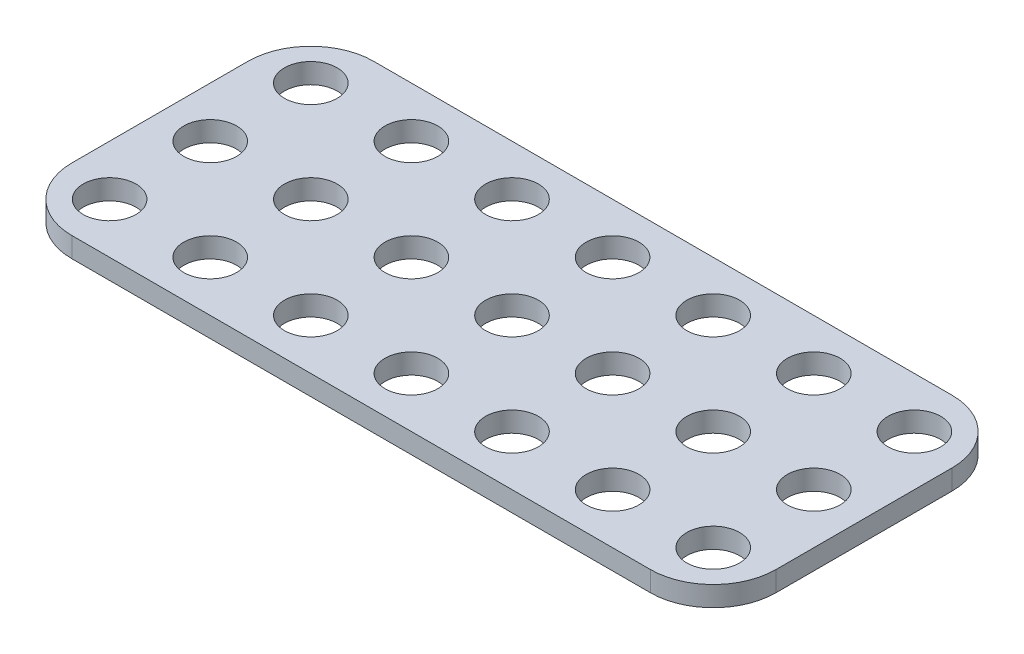
ISO-10303-21;
HEADER;
FILE_DESCRIPTION(('STEP AP214'),'2;1');
FILE_NAME('part.step','',(''),(''),'','','');
FILE_SCHEMA(('AUTOMOTIVE_DESIGN { 1 0 10303 214 1 1 1 1 }'));
ENDSEC;
DATA;
#1=APPLICATION_CONTEXT('core data for automotive mechanical design processes');
#2=APPLICATION_PROTOCOL_DEFINITION('international standard','automotive_design',2000,#1);
#3=PRODUCT_CONTEXT('',#1,'mechanical');
#4=PRODUCT('Part','Part','',(#3));
#5=PRODUCT_RELATED_PRODUCT_CATEGORY('part','',(#4));
#6=PRODUCT_DEFINITION_FORMATION('','',#4);
#7=PRODUCT_DEFINITION_CONTEXT('part definition',#1,'design');
#8=PRODUCT_DEFINITION('design','',#6,#7);
#9=PRODUCT_DEFINITION_SHAPE('','',#8);
#10=(LENGTH_UNIT() NAMED_UNIT(*) SI_UNIT(.MILLI.,.METRE.));
#11=(NAMED_UNIT(*) PLANE_ANGLE_UNIT() SI_UNIT($,.RADIAN.));
#12=(NAMED_UNIT(*) SI_UNIT($,.STERADIAN.) SOLID_ANGLE_UNIT());
#13=UNCERTAINTY_MEASURE_WITH_UNIT(LENGTH_MEASURE(1.E-05),#10,'distance_accuracy_value','');
#14=(GEOMETRIC_REPRESENTATION_CONTEXT(3) GLOBAL_UNCERTAINTY_ASSIGNED_CONTEXT((#13)) GLOBAL_UNIT_ASSIGNED_CONTEXT((#10,
#11,#12)) REPRESENTATION_CONTEXT('',''));
#15=CARTESIAN_POINT('',(0.,0.,0.));
#16=DIRECTION('',(0.,0.,1.));
#17=DIRECTION('',(1.,0.,0.));
#18=AXIS2_PLACEMENT_3D('',#15,#16,#17);
#19=CARTESIAN_POINT('',(0.,1.6,0.));
#20=DIRECTION('',(1.,0.,0.));
#21=DIRECTION('',(0.,0.,-1.));
#22=AXIS2_PLACEMENT_3D('',#19,#20,#21);
#23=PLANE('',#22);
#24=DIRECTION('',(0.,0.,1.));
#25=VECTOR('',#24,1.);
#26=CARTESIAN_POINT('',(0.,1.6,0.));
#27=LINE('',#26,#25);
#28=CARTESIAN_POINT('',(0.,1.6,5.));
#29=VERTEX_POINT('',#28);
#30=CARTESIAN_POINT('',(0.,1.6,19.));
#31=VERTEX_POINT('',#30);
#32=EDGE_CURVE('E117',#29,#31,#27,.T.);
#33=ORIENTED_EDGE('',*,*,#32,.F.);
#34=DIRECTION('',(0.,-1.,0.));
#35=VECTOR('',#34,1.);
#36=CARTESIAN_POINT('',(0.,1.6,5.));
#37=LINE('',#36,#35);
#38=CARTESIAN_POINT('',(0.,0.,5.));
#39=VERTEX_POINT('',#38);
#40=EDGE_CURVE('E102',#29,#39,#37,.T.);
#41=ORIENTED_EDGE('',*,*,#40,.T.);
#42=DIRECTION('',(0.,0.,1.));
#43=VECTOR('',#42,1.);
#44=CARTESIAN_POINT('',(0.,0.,0.));
#45=LINE('',#44,#43);
#46=CARTESIAN_POINT('',(0.,0.,19.));
#47=VERTEX_POINT('',#46);
#48=EDGE_CURVE('E114',#39,#47,#45,.T.);
#49=ORIENTED_EDGE('',*,*,#48,.T.);
#50=DIRECTION('',(0.,-1.,0.));
#51=VECTOR('',#50,1.);
#52=CARTESIAN_POINT('',(0.,1.6,19.));
#53=LINE('',#52,#51);
#54=EDGE_CURVE('E119',#47,#31,#53,.F.);
#55=ORIENTED_EDGE('',*,*,#54,.T.);
#56=EDGE_LOOP('',(#33,#41,#49,#55));
#57=FACE_BOUND('',#56,.T.);
#58=ADVANCED_FACE('F32',(#57),#23,.F.);
#59=CARTESIAN_POINT('',(0.,1.6,24.));
#60=DIRECTION('',(0.,0.,-1.));
#61=DIRECTION('',(-1.,0.,0.));
#62=AXIS2_PLACEMENT_3D('',#59,#60,#61);
#63=PLANE('',#62);
#64=DIRECTION('',(1.,0.,0.));
#65=VECTOR('',#64,1.);
#66=CARTESIAN_POINT('',(0.,0.,24.));
#67=LINE('',#66,#65);
#68=CARTESIAN_POINT('',(5.,0.,24.));
#69=VERTEX_POINT('',#68);
#70=CARTESIAN_POINT('',(51.,0.,24.));
#71=VERTEX_POINT('',#70);
#72=EDGE_CURVE('E123',#69,#71,#67,.T.);
#73=ORIENTED_EDGE('',*,*,#72,.T.);
#74=DIRECTION('',(0.,-1.,0.));
#75=VECTOR('',#74,1.);
#76=CARTESIAN_POINT('',(51.,1.6,24.));
#77=LINE('',#76,#75);
#78=CARTESIAN_POINT('',(51.,1.6,24.));
#79=VERTEX_POINT('',#78);
#80=EDGE_CURVE('E11',#71,#79,#77,.F.);
#81=ORIENTED_EDGE('',*,*,#80,.T.);
#82=DIRECTION('',(1.,0.,0.));
#83=VECTOR('',#82,1.);
#84=CARTESIAN_POINT('',(0.,1.6,24.));
#85=LINE('',#84,#83);
#86=CARTESIAN_POINT('',(5.,1.6,24.));
#87=VERTEX_POINT('',#86);
#88=EDGE_CURVE('E163',#87,#79,#85,.T.);
#89=ORIENTED_EDGE('',*,*,#88,.F.);
#90=DIRECTION('',(0.,-1.,0.));
#91=VECTOR('',#90,1.);
#92=CARTESIAN_POINT('',(5.,1.6,24.));
#93=LINE('',#92,#91);
#94=EDGE_CURVE('E40',#87,#69,#93,.T.);
#95=ORIENTED_EDGE('',*,*,#94,.T.);
#96=EDGE_LOOP('',(#73,#81,#89,#95));
#97=FACE_BOUND('',#96,.T.);
#98=ADVANCED_FACE('F161',(#97),#63,.F.);
#99=CARTESIAN_POINT('',(56.,1.6,0.));
#100=DIRECTION('',(-1.,0.,0.));
#101=DIRECTION('',(0.,0.,1.));
#102=AXIS2_PLACEMENT_3D('',#99,#100,#101);
#103=PLANE('',#102);
#104=DIRECTION('',(0.,0.,-1.));
#105=VECTOR('',#104,1.);
#106=CARTESIAN_POINT('',(56.,0.,0.));
#107=LINE('',#106,#105);
#108=CARTESIAN_POINT('',(56.,0.,19.));
#109=VERTEX_POINT('',#108);
#110=CARTESIAN_POINT('',(56.,0.,5.));
#111=VERTEX_POINT('',#110);
#112=EDGE_CURVE('E127',#109,#111,#107,.T.);
#113=ORIENTED_EDGE('',*,*,#112,.T.);
#114=DIRECTION('',(0.,-1.,0.));
#115=VECTOR('',#114,1.);
#116=CARTESIAN_POINT('',(56.,1.6,5.));
#117=LINE('',#116,#115);
#118=CARTESIAN_POINT('',(56.,1.6,5.));
#119=VERTEX_POINT('',#118);
#120=EDGE_CURVE('E47',#111,#119,#117,.F.);
#121=ORIENTED_EDGE('',*,*,#120,.T.);
#122=DIRECTION('',(0.,0.,-1.));
#123=VECTOR('',#122,1.);
#124=CARTESIAN_POINT('',(56.,1.6,0.));
#125=LINE('',#124,#123);
#126=CARTESIAN_POINT('',(56.,1.6,19.));
#127=VERTEX_POINT('',#126);
#128=EDGE_CURVE('E171',#127,#119,#125,.T.);
#129=ORIENTED_EDGE('',*,*,#128,.F.);
#130=DIRECTION('',(0.,-1.,0.));
#131=VECTOR('',#130,1.);
#132=CARTESIAN_POINT('',(56.,1.6,19.));
#133=LINE('',#132,#131);
#134=EDGE_CURVE('E154',#127,#109,#133,.T.);
#135=ORIENTED_EDGE('',*,*,#134,.T.);
#136=EDGE_LOOP('',(#113,#121,#129,#135));
#137=FACE_BOUND('',#136,.T.);
#138=ADVANCED_FACE('F170',(#137),#103,.F.);
#139=CARTESIAN_POINT('',(0.,1.6,0.));
#140=DIRECTION('',(0.,0.,1.));
#141=DIRECTION('',(1.,0.,0.));
#142=AXIS2_PLACEMENT_3D('',#139,#140,#141);
#143=PLANE('',#142);
#144=DIRECTION('',(-1.,0.,0.));
#145=VECTOR('',#144,1.);
#146=CARTESIAN_POINT('',(0.,0.,0.));
#147=LINE('',#146,#145);
#148=CARTESIAN_POINT('',(51.,0.,0.));
#149=VERTEX_POINT('',#148);
#150=CARTESIAN_POINT('',(5.,0.,0.));
#151=VERTEX_POINT('',#150);
#152=EDGE_CURVE('E137',#149,#151,#147,.T.);
#153=ORIENTED_EDGE('',*,*,#152,.T.);
#154=DIRECTION('',(0.,-1.,0.));
#155=VECTOR('',#154,1.);
#156=CARTESIAN_POINT('',(5.,1.6,0.));
#157=LINE('',#156,#155);
#158=CARTESIAN_POINT('',(5.,1.6,0.));
#159=VERTEX_POINT('',#158);
#160=EDGE_CURVE('E103',#151,#159,#157,.F.);
#161=ORIENTED_EDGE('',*,*,#160,.T.);
#162=DIRECTION('',(-1.,0.,0.));
#163=VECTOR('',#162,1.);
#164=CARTESIAN_POINT('',(0.,1.6,0.));
#165=LINE('',#164,#163);
#166=CARTESIAN_POINT('',(51.,1.6,0.));
#167=VERTEX_POINT('',#166);
#168=EDGE_CURVE('E133',#167,#159,#165,.T.);
#169=ORIENTED_EDGE('',*,*,#168,.F.);
#170=DIRECTION('',(0.,-1.,0.));
#171=VECTOR('',#170,1.);
#172=CARTESIAN_POINT('',(51.,1.6,0.));
#173=LINE('',#172,#171);
#174=EDGE_CURVE('E108',#167,#149,#173,.T.);
#175=ORIENTED_EDGE('',*,*,#174,.T.);
#176=EDGE_LOOP('',(#153,#161,#169,#175));
#177=FACE_BOUND('',#176,.T.);
#178=ADVANCED_FACE('F312',(#177),#143,.F.);
#179=CARTESIAN_POINT('',(0.,1.6,0.));
#180=DIRECTION('',(0.,1.,0.));
#181=DIRECTION('',(0.,0.,1.));
#182=AXIS2_PLACEMENT_3D('',#179,#180,#181);
#183=PLANE('',#182);
#184=CARTESIAN_POINT('',(52.,1.6,20.));
#185=DIRECTION('',(0.,1.,0.));
#186=DIRECTION('',(0.,0.,1.));
#187=AXIS2_PLACEMENT_3D('',#184,#185,#186);
#188=CIRCLE('',#187,2.1);
#189=CARTESIAN_POINT('',(52.,1.6,22.1));
#190=VERTEX_POINT('',#189);
#191=EDGE_CURVE('E294',#190,#190,#188,.T.);
#192=ORIENTED_EDGE('',*,*,#191,.F.);
#193=EDGE_LOOP('',(#192));
#194=FACE_BOUND('',#193,.T.);
#195=CARTESIAN_POINT('',(52.,1.6,12.));
#196=DIRECTION('',(0.,1.,0.));
#197=DIRECTION('',(0.,0.,1.));
#198=AXIS2_PLACEMENT_3D('',#195,#196,#197);
#199=CIRCLE('',#198,2.1);
#200=CARTESIAN_POINT('',(52.,1.6,14.1));
#201=VERTEX_POINT('',#200);
#202=EDGE_CURVE('E288',#201,#201,#199,.T.);
#203=ORIENTED_EDGE('',*,*,#202,.F.);
#204=EDGE_LOOP('',(#203));
#205=FACE_BOUND('',#204,.T.);
#206=CARTESIAN_POINT('',(52.,1.6,4.));
#207=DIRECTION('',(0.,1.,0.));
#208=DIRECTION('',(0.,0.,1.));
#209=AXIS2_PLACEMENT_3D('',#206,#207,#208);
#210=CIRCLE('',#209,2.1);
#211=CARTESIAN_POINT('',(52.,1.6,6.1));
#212=VERTEX_POINT('',#211);
#213=EDGE_CURVE('E282',#212,#212,#210,.T.);
#214=ORIENTED_EDGE('',*,*,#213,.F.);
#215=EDGE_LOOP('',(#214));
#216=FACE_BOUND('',#215,.T.);
#217=CARTESIAN_POINT('',(44.,1.6,20.));
#218=DIRECTION('',(0.,1.,0.));
#219=DIRECTION('',(0.,0.,1.));
#220=AXIS2_PLACEMENT_3D('',#217,#218,#219);
#221=CIRCLE('',#220,2.1);
#222=CARTESIAN_POINT('',(44.,1.6,22.1));
#223=VERTEX_POINT('',#222);
#224=EDGE_CURVE('E276',#223,#223,#221,.T.);
#225=ORIENTED_EDGE('',*,*,#224,.F.);
#226=EDGE_LOOP('',(#225));
#227=FACE_BOUND('',#226,.T.);
#228=CARTESIAN_POINT('',(44.,1.6,12.));
#229=DIRECTION('',(0.,1.,0.));
#230=DIRECTION('',(0.,0.,1.));
#231=AXIS2_PLACEMENT_3D('',#228,#229,#230);
#232=CIRCLE('',#231,2.1);
#233=CARTESIAN_POINT('',(44.,1.6,14.1));
#234=VERTEX_POINT('',#233);
#235=EDGE_CURVE('E270',#234,#234,#232,.T.);
#236=ORIENTED_EDGE('',*,*,#235,.F.);
#237=EDGE_LOOP('',(#236));
#238=FACE_BOUND('',#237,.T.);
#239=CARTESIAN_POINT('',(44.,1.6,4.));
#240=DIRECTION('',(0.,1.,0.));
#241=DIRECTION('',(0.,0.,1.));
#242=AXIS2_PLACEMENT_3D('',#239,#240,#241);
#243=CIRCLE('',#242,2.1);
#244=CARTESIAN_POINT('',(44.,1.6,6.1));
#245=VERTEX_POINT('',#244);
#246=EDGE_CURVE('E264',#245,#245,#243,.T.);
#247=ORIENTED_EDGE('',*,*,#246,.F.);
#248=EDGE_LOOP('',(#247));
#249=FACE_BOUND('',#248,.T.);
#250=CARTESIAN_POINT('',(36.,1.6,20.));
#251=DIRECTION('',(0.,1.,0.));
#252=DIRECTION('',(0.,0.,1.));
#253=AXIS2_PLACEMENT_3D('',#250,#251,#252);
#254=CIRCLE('',#253,2.1);
#255=CARTESIAN_POINT('',(36.,1.6,22.1));
#256=VERTEX_POINT('',#255);
#257=EDGE_CURVE('E258',#256,#256,#254,.T.);
#258=ORIENTED_EDGE('',*,*,#257,.F.);
#259=EDGE_LOOP('',(#258));
#260=FACE_BOUND('',#259,.T.);
#261=CARTESIAN_POINT('',(36.,1.6,12.));
#262=DIRECTION('',(0.,1.,0.));
#263=DIRECTION('',(0.,0.,1.));
#264=AXIS2_PLACEMENT_3D('',#261,#262,#263);
#265=CIRCLE('',#264,2.1);
#266=CARTESIAN_POINT('',(36.,1.6,14.1));
#267=VERTEX_POINT('',#266);
#268=EDGE_CURVE('E252',#267,#267,#265,.T.);
#269=ORIENTED_EDGE('',*,*,#268,.F.);
#270=EDGE_LOOP('',(#269));
#271=FACE_BOUND('',#270,.T.);
#272=CARTESIAN_POINT('',(36.,1.6,4.));
#273=DIRECTION('',(0.,1.,0.));
#274=DIRECTION('',(0.,0.,1.));
#275=AXIS2_PLACEMENT_3D('',#272,#273,#274);
#276=CIRCLE('',#275,2.1);
#277=CARTESIAN_POINT('',(36.,1.6,6.1));
#278=VERTEX_POINT('',#277);
#279=EDGE_CURVE('E246',#278,#278,#276,.T.);
#280=ORIENTED_EDGE('',*,*,#279,.F.);
#281=EDGE_LOOP('',(#280));
#282=FACE_BOUND('',#281,.T.);
#283=CARTESIAN_POINT('',(28.,1.6,20.));
#284=DIRECTION('',(0.,1.,0.));
#285=DIRECTION('',(0.,0.,1.));
#286=AXIS2_PLACEMENT_3D('',#283,#284,#285);
#287=CIRCLE('',#286,2.1);
#288=CARTESIAN_POINT('',(28.,1.6,22.1));
#289=VERTEX_POINT('',#288);
#290=EDGE_CURVE('E240',#289,#289,#287,.T.);
#291=ORIENTED_EDGE('',*,*,#290,.F.);
#292=EDGE_LOOP('',(#291));
#293=FACE_BOUND('',#292,.T.);
#294=CARTESIAN_POINT('',(28.,1.6,12.));
#295=DIRECTION('',(0.,1.,0.));
#296=DIRECTION('',(0.,0.,1.));
#297=AXIS2_PLACEMENT_3D('',#294,#295,#296);
#298=CIRCLE('',#297,2.1);
#299=CARTESIAN_POINT('',(28.,1.6,14.1));
#300=VERTEX_POINT('',#299);
#301=EDGE_CURVE('E234',#300,#300,#298,.T.);
#302=ORIENTED_EDGE('',*,*,#301,.F.);
#303=EDGE_LOOP('',(#302));
#304=FACE_BOUND('',#303,.T.);
#305=CARTESIAN_POINT('',(28.,1.6,4.));
#306=DIRECTION('',(0.,1.,0.));
#307=DIRECTION('',(0.,0.,1.));
#308=AXIS2_PLACEMENT_3D('',#305,#306,#307);
#309=CIRCLE('',#308,2.1);
#310=CARTESIAN_POINT('',(28.,1.6,6.1));
#311=VERTEX_POINT('',#310);
#312=EDGE_CURVE('E228',#311,#311,#309,.T.);
#313=ORIENTED_EDGE('',*,*,#312,.F.);
#314=EDGE_LOOP('',(#313));
#315=FACE_BOUND('',#314,.T.);
#316=CARTESIAN_POINT('',(20.,1.6,20.));
#317=DIRECTION('',(0.,1.,0.));
#318=DIRECTION('',(0.,0.,1.));
#319=AXIS2_PLACEMENT_3D('',#316,#317,#318);
#320=CIRCLE('',#319,2.1);
#321=CARTESIAN_POINT('',(20.,1.6,22.1));
#322=VERTEX_POINT('',#321);
#323=EDGE_CURVE('E222',#322,#322,#320,.T.);
#324=ORIENTED_EDGE('',*,*,#323,.F.);
#325=EDGE_LOOP('',(#324));
#326=FACE_BOUND('',#325,.T.);
#327=CARTESIAN_POINT('',(20.,1.6,12.));
#328=DIRECTION('',(0.,1.,0.));
#329=DIRECTION('',(0.,0.,1.));
#330=AXIS2_PLACEMENT_3D('',#327,#328,#329);
#331=CIRCLE('',#330,2.1);
#332=CARTESIAN_POINT('',(20.,1.6,14.1));
#333=VERTEX_POINT('',#332);
#334=EDGE_CURVE('E216',#333,#333,#331,.T.);
#335=ORIENTED_EDGE('',*,*,#334,.F.);
#336=EDGE_LOOP('',(#335));
#337=FACE_BOUND('',#336,.T.);
#338=CARTESIAN_POINT('',(20.,1.6,4.));
#339=DIRECTION('',(0.,1.,0.));
#340=DIRECTION('',(0.,0.,1.));
#341=AXIS2_PLACEMENT_3D('',#338,#339,#340);
#342=CIRCLE('',#341,2.1);
#343=CARTESIAN_POINT('',(20.,1.6,6.1));
#344=VERTEX_POINT('',#343);
#345=EDGE_CURVE('E210',#344,#344,#342,.T.);
#346=ORIENTED_EDGE('',*,*,#345,.F.);
#347=EDGE_LOOP('',(#346));
#348=FACE_BOUND('',#347,.T.);
#349=CARTESIAN_POINT('',(12.,1.6,20.));
#350=DIRECTION('',(0.,1.,0.));
#351=DIRECTION('',(0.,0.,1.));
#352=AXIS2_PLACEMENT_3D('',#349,#350,#351);
#353=CIRCLE('',#352,2.1);
#354=CARTESIAN_POINT('',(12.,1.6,22.1));
#355=VERTEX_POINT('',#354);
#356=EDGE_CURVE('E204',#355,#355,#353,.T.);
#357=ORIENTED_EDGE('',*,*,#356,.F.);
#358=EDGE_LOOP('',(#357));
#359=FACE_BOUND('',#358,.T.);
#360=CARTESIAN_POINT('',(12.,1.6,12.));
#361=DIRECTION('',(0.,1.,0.));
#362=DIRECTION('',(0.,0.,1.));
#363=AXIS2_PLACEMENT_3D('',#360,#361,#362);
#364=CIRCLE('',#363,2.1);
#365=CARTESIAN_POINT('',(12.,1.6,14.1));
#366=VERTEX_POINT('',#365);
#367=EDGE_CURVE('E198',#366,#366,#364,.T.);
#368=ORIENTED_EDGE('',*,*,#367,.F.);
#369=EDGE_LOOP('',(#368));
#370=FACE_BOUND('',#369,.T.);
#371=CARTESIAN_POINT('',(12.,1.6,4.));
#372=DIRECTION('',(0.,1.,0.));
#373=DIRECTION('',(0.,0.,1.));
#374=AXIS2_PLACEMENT_3D('',#371,#372,#373);
#375=CIRCLE('',#374,2.1);
#376=CARTESIAN_POINT('',(12.,1.6,6.1));
#377=VERTEX_POINT('',#376);
#378=EDGE_CURVE('E192',#377,#377,#375,.T.);
#379=ORIENTED_EDGE('',*,*,#378,.F.);
#380=EDGE_LOOP('',(#379));
#381=FACE_BOUND('',#380,.T.);
#382=CARTESIAN_POINT('',(4.,1.6,20.));
#383=DIRECTION('',(0.,1.,0.));
#384=DIRECTION('',(0.,0.,1.));
#385=AXIS2_PLACEMENT_3D('',#382,#383,#384);
#386=CIRCLE('',#385,2.1);
#387=CARTESIAN_POINT('',(4.,1.6,22.1));
#388=VERTEX_POINT('',#387);
#389=EDGE_CURVE('E186',#388,#388,#386,.T.);
#390=ORIENTED_EDGE('',*,*,#389,.F.);
#391=EDGE_LOOP('',(#390));
#392=FACE_BOUND('',#391,.T.);
#393=CARTESIAN_POINT('',(4.,1.6,12.));
#394=DIRECTION('',(0.,1.,0.));
#395=DIRECTION('',(0.,0.,1.));
#396=AXIS2_PLACEMENT_3D('',#393,#394,#395);
#397=CIRCLE('',#396,2.1);
#398=CARTESIAN_POINT('',(4.,1.6,14.1));
#399=VERTEX_POINT('',#398);
#400=EDGE_CURVE('E180',#399,#399,#397,.T.);
#401=ORIENTED_EDGE('',*,*,#400,.F.);
#402=EDGE_LOOP('',(#401));
#403=FACE_BOUND('',#402,.T.);
#404=CARTESIAN_POINT('',(4.,1.6,4.));
#405=DIRECTION('',(0.,1.,0.));
#406=DIRECTION('',(0.,0.,1.));
#407=AXIS2_PLACEMENT_3D('',#404,#405,#406);
#408=CIRCLE('',#407,2.1);
#409=CARTESIAN_POINT('',(4.,1.6,6.1));
#410=VERTEX_POINT('',#409);
#411=EDGE_CURVE('E130',#410,#410,#408,.T.);
#412=ORIENTED_EDGE('',*,*,#411,.F.);
#413=EDGE_LOOP('',(#412));
#414=FACE_BOUND('',#413,.T.);
#415=ORIENTED_EDGE('',*,*,#168,.T.);
#416=CARTESIAN_POINT('',(5.,1.6,5.));
#417=DIRECTION('',(0.,1.,0.));
#418=DIRECTION('',(0.,0.,1.));
#419=AXIS2_PLACEMENT_3D('',#416,#417,#418);
#420=CIRCLE('',#419,5.);
#421=EDGE_CURVE('E152',#159,#29,#420,.T.);
#422=ORIENTED_EDGE('',*,*,#421,.T.);
#423=ORIENTED_EDGE('',*,*,#32,.T.);
#424=CARTESIAN_POINT('',(5.,1.6,19.));
#425=DIRECTION('',(0.,1.,0.));
#426=DIRECTION('',(0.,0.,1.));
#427=AXIS2_PLACEMENT_3D('',#424,#425,#426);
#428=CIRCLE('',#427,5.);
#429=EDGE_CURVE('E147',#31,#87,#428,.T.);
#430=ORIENTED_EDGE('',*,*,#429,.T.);
#431=ORIENTED_EDGE('',*,*,#88,.T.);
#432=CARTESIAN_POINT('',(51.,1.6,19.));
#433=DIRECTION('',(0.,1.,0.));
#434=DIRECTION('',(0.,0.,1.));
#435=AXIS2_PLACEMENT_3D('',#432,#433,#434);
#436=CIRCLE('',#435,5.);
#437=EDGE_CURVE('E54',#79,#127,#436,.T.);
#438=ORIENTED_EDGE('',*,*,#437,.T.);
#439=ORIENTED_EDGE('',*,*,#128,.T.);
#440=CARTESIAN_POINT('',(51.,1.6,5.));
#441=DIRECTION('',(0.,1.,0.));
#442=DIRECTION('',(0.,0.,1.));
#443=AXIS2_PLACEMENT_3D('',#440,#441,#442);
#444=CIRCLE('',#443,5.);
#445=EDGE_CURVE('E150',#119,#167,#444,.T.);
#446=ORIENTED_EDGE('',*,*,#445,.T.);
#447=EDGE_LOOP('',(#415,#422,#423,#430,#431,#438,#439,#446));
#448=FACE_BOUND('',#447,.T.);
#449=ADVANCED_FACE('F309',(#194,#205,#216,#227,#238,#249,#260,#271,#282,#293,#304,#315,#326,
#337,#348,#359,#370,#381,#392,#403,#414,#448),#183,.T.);
#450=CARTESIAN_POINT('',(0.,0.,0.));
#451=DIRECTION('',(0.,1.,0.));
#452=DIRECTION('',(0.,0.,1.));
#453=AXIS2_PLACEMENT_3D('',#450,#451,#452);
#454=PLANE('',#453);
#455=CARTESIAN_POINT('',(52.,0.,20.));
#456=DIRECTION('',(0.,1.,0.));
#457=DIRECTION('',(0.,0.,1.));
#458=AXIS2_PLACEMENT_3D('',#455,#456,#457);
#459=CIRCLE('',#458,2.1);
#460=CARTESIAN_POINT('',(52.,0.,22.1));
#461=VERTEX_POINT('',#460);
#462=EDGE_CURVE('E291',#461,#461,#459,.T.);
#463=ORIENTED_EDGE('',*,*,#462,.T.);
#464=EDGE_LOOP('',(#463));
#465=FACE_BOUND('',#464,.T.);
#466=CARTESIAN_POINT('',(52.,0.,12.));
#467=DIRECTION('',(0.,1.,0.));
#468=DIRECTION('',(0.,0.,1.));
#469=AXIS2_PLACEMENT_3D('',#466,#467,#468);
#470=CIRCLE('',#469,2.1);
#471=CARTESIAN_POINT('',(52.,0.,14.1));
#472=VERTEX_POINT('',#471);
#473=EDGE_CURVE('E285',#472,#472,#470,.T.);
#474=ORIENTED_EDGE('',*,*,#473,.T.);
#475=EDGE_LOOP('',(#474));
#476=FACE_BOUND('',#475,.T.);
#477=CARTESIAN_POINT('',(52.,0.,4.));
#478=DIRECTION('',(0.,1.,0.));
#479=DIRECTION('',(0.,0.,1.));
#480=AXIS2_PLACEMENT_3D('',#477,#478,#479);
#481=CIRCLE('',#480,2.1);
#482=CARTESIAN_POINT('',(52.,0.,6.1));
#483=VERTEX_POINT('',#482);
#484=EDGE_CURVE('E279',#483,#483,#481,.T.);
#485=ORIENTED_EDGE('',*,*,#484,.T.);
#486=EDGE_LOOP('',(#485));
#487=FACE_BOUND('',#486,.T.);
#488=CARTESIAN_POINT('',(44.,0.,20.));
#489=DIRECTION('',(0.,1.,0.));
#490=DIRECTION('',(0.,0.,1.));
#491=AXIS2_PLACEMENT_3D('',#488,#489,#490);
#492=CIRCLE('',#491,2.1);
#493=CARTESIAN_POINT('',(44.,0.,22.1));
#494=VERTEX_POINT('',#493);
#495=EDGE_CURVE('E273',#494,#494,#492,.T.);
#496=ORIENTED_EDGE('',*,*,#495,.T.);
#497=EDGE_LOOP('',(#496));
#498=FACE_BOUND('',#497,.T.);
#499=CARTESIAN_POINT('',(44.,0.,12.));
#500=DIRECTION('',(0.,1.,0.));
#501=DIRECTION('',(0.,0.,1.));
#502=AXIS2_PLACEMENT_3D('',#499,#500,#501);
#503=CIRCLE('',#502,2.1);
#504=CARTESIAN_POINT('',(44.,0.,14.1));
#505=VERTEX_POINT('',#504);
#506=EDGE_CURVE('E267',#505,#505,#503,.T.);
#507=ORIENTED_EDGE('',*,*,#506,.T.);
#508=EDGE_LOOP('',(#507));
#509=FACE_BOUND('',#508,.T.);
#510=CARTESIAN_POINT('',(44.,0.,4.));
#511=DIRECTION('',(0.,1.,0.));
#512=DIRECTION('',(0.,0.,1.));
#513=AXIS2_PLACEMENT_3D('',#510,#511,#512);
#514=CIRCLE('',#513,2.1);
#515=CARTESIAN_POINT('',(44.,0.,6.1));
#516=VERTEX_POINT('',#515);
#517=EDGE_CURVE('E261',#516,#516,#514,.T.);
#518=ORIENTED_EDGE('',*,*,#517,.T.);
#519=EDGE_LOOP('',(#518));
#520=FACE_BOUND('',#519,.T.);
#521=CARTESIAN_POINT('',(36.,0.,20.));
#522=DIRECTION('',(0.,1.,0.));
#523=DIRECTION('',(0.,0.,1.));
#524=AXIS2_PLACEMENT_3D('',#521,#522,#523);
#525=CIRCLE('',#524,2.1);
#526=CARTESIAN_POINT('',(36.,0.,22.1));
#527=VERTEX_POINT('',#526);
#528=EDGE_CURVE('E255',#527,#527,#525,.T.);
#529=ORIENTED_EDGE('',*,*,#528,.T.);
#530=EDGE_LOOP('',(#529));
#531=FACE_BOUND('',#530,.T.);
#532=CARTESIAN_POINT('',(36.,0.,12.));
#533=DIRECTION('',(0.,1.,0.));
#534=DIRECTION('',(0.,0.,1.));
#535=AXIS2_PLACEMENT_3D('',#532,#533,#534);
#536=CIRCLE('',#535,2.1);
#537=CARTESIAN_POINT('',(36.,0.,14.1));
#538=VERTEX_POINT('',#537);
#539=EDGE_CURVE('E249',#538,#538,#536,.T.);
#540=ORIENTED_EDGE('',*,*,#539,.T.);
#541=EDGE_LOOP('',(#540));
#542=FACE_BOUND('',#541,.T.);
#543=CARTESIAN_POINT('',(36.,0.,4.));
#544=DIRECTION('',(0.,1.,0.));
#545=DIRECTION('',(0.,0.,1.));
#546=AXIS2_PLACEMENT_3D('',#543,#544,#545);
#547=CIRCLE('',#546,2.1);
#548=CARTESIAN_POINT('',(36.,0.,6.1));
#549=VERTEX_POINT('',#548);
#550=EDGE_CURVE('E243',#549,#549,#547,.T.);
#551=ORIENTED_EDGE('',*,*,#550,.T.);
#552=EDGE_LOOP('',(#551));
#553=FACE_BOUND('',#552,.T.);
#554=CARTESIAN_POINT('',(28.,0.,20.));
#555=DIRECTION('',(0.,1.,0.));
#556=DIRECTION('',(0.,0.,1.));
#557=AXIS2_PLACEMENT_3D('',#554,#555,#556);
#558=CIRCLE('',#557,2.1);
#559=CARTESIAN_POINT('',(28.,0.,22.1));
#560=VERTEX_POINT('',#559);
#561=EDGE_CURVE('E237',#560,#560,#558,.T.);
#562=ORIENTED_EDGE('',*,*,#561,.T.);
#563=EDGE_LOOP('',(#562));
#564=FACE_BOUND('',#563,.T.);
#565=CARTESIAN_POINT('',(28.,0.,12.));
#566=DIRECTION('',(0.,1.,0.));
#567=DIRECTION('',(0.,0.,1.));
#568=AXIS2_PLACEMENT_3D('',#565,#566,#567);
#569=CIRCLE('',#568,2.1);
#570=CARTESIAN_POINT('',(28.,0.,14.1));
#571=VERTEX_POINT('',#570);
#572=EDGE_CURVE('E231',#571,#571,#569,.T.);
#573=ORIENTED_EDGE('',*,*,#572,.T.);
#574=EDGE_LOOP('',(#573));
#575=FACE_BOUND('',#574,.T.);
#576=CARTESIAN_POINT('',(28.,0.,4.));
#577=DIRECTION('',(0.,1.,0.));
#578=DIRECTION('',(0.,0.,1.));
#579=AXIS2_PLACEMENT_3D('',#576,#577,#578);
#580=CIRCLE('',#579,2.1);
#581=CARTESIAN_POINT('',(28.,0.,6.1));
#582=VERTEX_POINT('',#581);
#583=EDGE_CURVE('E225',#582,#582,#580,.T.);
#584=ORIENTED_EDGE('',*,*,#583,.T.);
#585=EDGE_LOOP('',(#584));
#586=FACE_BOUND('',#585,.T.);
#587=CARTESIAN_POINT('',(20.,0.,20.));
#588=DIRECTION('',(0.,1.,0.));
#589=DIRECTION('',(0.,0.,1.));
#590=AXIS2_PLACEMENT_3D('',#587,#588,#589);
#591=CIRCLE('',#590,2.1);
#592=CARTESIAN_POINT('',(20.,0.,22.1));
#593=VERTEX_POINT('',#592);
#594=EDGE_CURVE('E219',#593,#593,#591,.T.);
#595=ORIENTED_EDGE('',*,*,#594,.T.);
#596=EDGE_LOOP('',(#595));
#597=FACE_BOUND('',#596,.T.);
#598=CARTESIAN_POINT('',(20.,0.,12.));
#599=DIRECTION('',(0.,1.,0.));
#600=DIRECTION('',(0.,0.,1.));
#601=AXIS2_PLACEMENT_3D('',#598,#599,#600);
#602=CIRCLE('',#601,2.1);
#603=CARTESIAN_POINT('',(20.,0.,14.1));
#604=VERTEX_POINT('',#603);
#605=EDGE_CURVE('E213',#604,#604,#602,.T.);
#606=ORIENTED_EDGE('',*,*,#605,.T.);
#607=EDGE_LOOP('',(#606));
#608=FACE_BOUND('',#607,.T.);
#609=CARTESIAN_POINT('',(20.,0.,4.));
#610=DIRECTION('',(0.,1.,0.));
#611=DIRECTION('',(0.,0.,1.));
#612=AXIS2_PLACEMENT_3D('',#609,#610,#611);
#613=CIRCLE('',#612,2.1);
#614=CARTESIAN_POINT('',(20.,0.,6.1));
#615=VERTEX_POINT('',#614);
#616=EDGE_CURVE('E207',#615,#615,#613,.T.);
#617=ORIENTED_EDGE('',*,*,#616,.T.);
#618=EDGE_LOOP('',(#617));
#619=FACE_BOUND('',#618,.T.);
#620=CARTESIAN_POINT('',(12.,0.,20.));
#621=DIRECTION('',(0.,1.,0.));
#622=DIRECTION('',(0.,0.,1.));
#623=AXIS2_PLACEMENT_3D('',#620,#621,#622);
#624=CIRCLE('',#623,2.1);
#625=CARTESIAN_POINT('',(12.,0.,22.1));
#626=VERTEX_POINT('',#625);
#627=EDGE_CURVE('E201',#626,#626,#624,.T.);
#628=ORIENTED_EDGE('',*,*,#627,.T.);
#629=EDGE_LOOP('',(#628));
#630=FACE_BOUND('',#629,.T.);
#631=CARTESIAN_POINT('',(12.,0.,12.));
#632=DIRECTION('',(0.,1.,0.));
#633=DIRECTION('',(0.,0.,1.));
#634=AXIS2_PLACEMENT_3D('',#631,#632,#633);
#635=CIRCLE('',#634,2.1);
#636=CARTESIAN_POINT('',(12.,0.,14.1));
#637=VERTEX_POINT('',#636);
#638=EDGE_CURVE('E195',#637,#637,#635,.T.);
#639=ORIENTED_EDGE('',*,*,#638,.T.);
#640=EDGE_LOOP('',(#639));
#641=FACE_BOUND('',#640,.T.);
#642=CARTESIAN_POINT('',(12.,0.,4.));
#643=DIRECTION('',(0.,1.,0.));
#644=DIRECTION('',(0.,0.,1.));
#645=AXIS2_PLACEMENT_3D('',#642,#643,#644);
#646=CIRCLE('',#645,2.1);
#647=CARTESIAN_POINT('',(12.,0.,6.1));
#648=VERTEX_POINT('',#647);
#649=EDGE_CURVE('E189',#648,#648,#646,.T.);
#650=ORIENTED_EDGE('',*,*,#649,.T.);
#651=EDGE_LOOP('',(#650));
#652=FACE_BOUND('',#651,.T.);
#653=CARTESIAN_POINT('',(4.,0.,20.));
#654=DIRECTION('',(0.,1.,0.));
#655=DIRECTION('',(0.,0.,1.));
#656=AXIS2_PLACEMENT_3D('',#653,#654,#655);
#657=CIRCLE('',#656,2.1);
#658=CARTESIAN_POINT('',(4.,0.,22.1));
#659=VERTEX_POINT('',#658);
#660=EDGE_CURVE('E183',#659,#659,#657,.T.);
#661=ORIENTED_EDGE('',*,*,#660,.T.);
#662=EDGE_LOOP('',(#661));
#663=FACE_BOUND('',#662,.T.);
#664=CARTESIAN_POINT('',(4.,0.,12.));
#665=DIRECTION('',(0.,1.,0.));
#666=DIRECTION('',(0.,0.,1.));
#667=AXIS2_PLACEMENT_3D('',#664,#665,#666);
#668=CIRCLE('',#667,2.1);
#669=CARTESIAN_POINT('',(4.,0.,14.1));
#670=VERTEX_POINT('',#669);
#671=EDGE_CURVE('E178',#670,#670,#668,.T.);
#672=ORIENTED_EDGE('',*,*,#671,.T.);
#673=EDGE_LOOP('',(#672));
#674=FACE_BOUND('',#673,.T.);
#675=CARTESIAN_POINT('',(4.,0.,4.));
#676=DIRECTION('',(0.,1.,0.));
#677=DIRECTION('',(0.,0.,1.));
#678=AXIS2_PLACEMENT_3D('',#675,#676,#677);
#679=CIRCLE('',#678,2.1);
#680=CARTESIAN_POINT('',(4.,0.,6.1));
#681=VERTEX_POINT('',#680);
#682=EDGE_CURVE('E124',#681,#681,#679,.T.);
#683=ORIENTED_EDGE('',*,*,#682,.T.);
#684=EDGE_LOOP('',(#683));
#685=FACE_BOUND('',#684,.T.);
#686=ORIENTED_EDGE('',*,*,#48,.F.);
#687=CARTESIAN_POINT('',(5.,0.,5.));
#688=DIRECTION('',(0.,1.,0.));
#689=DIRECTION('',(0.,0.,1.));
#690=AXIS2_PLACEMENT_3D('',#687,#688,#689);
#691=CIRCLE('',#690,5.);
#692=EDGE_CURVE('E98',#39,#151,#691,.F.);
#693=ORIENTED_EDGE('',*,*,#692,.T.);
#694=ORIENTED_EDGE('',*,*,#152,.F.);
#695=CARTESIAN_POINT('',(51.,0.,5.));
#696=DIRECTION('',(0.,1.,0.));
#697=DIRECTION('',(0.,0.,1.));
#698=AXIS2_PLACEMENT_3D('',#695,#696,#697);
#699=CIRCLE('',#698,5.);
#700=EDGE_CURVE('E109',#149,#111,#699,.F.);
#701=ORIENTED_EDGE('',*,*,#700,.T.);
#702=ORIENTED_EDGE('',*,*,#112,.F.);
#703=CARTESIAN_POINT('',(51.,0.,19.));
#704=DIRECTION('',(0.,1.,0.));
#705=DIRECTION('',(0.,0.,1.));
#706=AXIS2_PLACEMENT_3D('',#703,#704,#705);
#707=CIRCLE('',#706,5.);
#708=EDGE_CURVE('E141',#109,#71,#707,.F.);
#709=ORIENTED_EDGE('',*,*,#708,.T.);
#710=ORIENTED_EDGE('',*,*,#72,.F.);
#711=CARTESIAN_POINT('',(5.,0.,19.));
#712=DIRECTION('',(0.,1.,0.));
#713=DIRECTION('',(0.,0.,1.));
#714=AXIS2_PLACEMENT_3D('',#711,#712,#713);
#715=CIRCLE('',#714,5.);
#716=EDGE_CURVE('E118',#69,#47,#715,.F.);
#717=ORIENTED_EDGE('',*,*,#716,.T.);
#718=EDGE_LOOP('',(#686,#693,#694,#701,#702,#709,#710,#717));
#719=FACE_BOUND('',#718,.T.);
#720=ADVANCED_FACE('F121',(#465,#476,#487,#498,#509,#520,#531,#542,#553,#564,#575,#586,#597,
#608,#619,#630,#641,#652,#663,#674,#685,#719),#454,.F.);
#721=CARTESIAN_POINT('',(5.,1.6,5.));
#722=DIRECTION('',(0.,-1.,0.));
#723=DIRECTION('',(0.,0.,-1.));
#724=AXIS2_PLACEMENT_3D('',#721,#722,#723);
#725=CYLINDRICAL_SURFACE('',#724,5.);
#726=ORIENTED_EDGE('',*,*,#421,.F.);
#727=ORIENTED_EDGE('',*,*,#160,.F.);
#728=ORIENTED_EDGE('',*,*,#692,.F.);
#729=ORIENTED_EDGE('',*,*,#40,.F.);
#730=EDGE_LOOP('',(#726,#727,#728,#729));
#731=FACE_BOUND('',#730,.T.);
#732=ADVANCED_FACE('F101',(#731),#725,.T.);
#733=CARTESIAN_POINT('',(51.,1.6,5.));
#734=DIRECTION('',(0.,-1.,0.));
#735=DIRECTION('',(0.,0.,-1.));
#736=AXIS2_PLACEMENT_3D('',#733,#734,#735);
#737=CYLINDRICAL_SURFACE('',#736,5.);
#738=ORIENTED_EDGE('',*,*,#445,.F.);
#739=ORIENTED_EDGE('',*,*,#120,.F.);
#740=ORIENTED_EDGE('',*,*,#700,.F.);
#741=ORIENTED_EDGE('',*,*,#174,.F.);
#742=EDGE_LOOP('',(#738,#739,#740,#741));
#743=FACE_BOUND('',#742,.T.);
#744=ADVANCED_FACE('F357',(#743),#737,.T.);
#745=CARTESIAN_POINT('',(51.,1.6,19.));
#746=DIRECTION('',(0.,-1.,0.));
#747=DIRECTION('',(0.,0.,-1.));
#748=AXIS2_PLACEMENT_3D('',#745,#746,#747);
#749=CYLINDRICAL_SURFACE('',#748,5.);
#750=ORIENTED_EDGE('',*,*,#437,.F.);
#751=ORIENTED_EDGE('',*,*,#80,.F.);
#752=ORIENTED_EDGE('',*,*,#708,.F.);
#753=ORIENTED_EDGE('',*,*,#134,.F.);
#754=EDGE_LOOP('',(#750,#751,#752,#753));
#755=FACE_BOUND('',#754,.T.);
#756=ADVANCED_FACE('F169',(#755),#749,.T.);
#757=CARTESIAN_POINT('',(5.,1.6,19.));
#758=DIRECTION('',(0.,-1.,0.));
#759=DIRECTION('',(0.,0.,-1.));
#760=AXIS2_PLACEMENT_3D('',#757,#758,#759);
#761=CYLINDRICAL_SURFACE('',#760,5.);
#762=ORIENTED_EDGE('',*,*,#429,.F.);
#763=ORIENTED_EDGE('',*,*,#54,.F.);
#764=ORIENTED_EDGE('',*,*,#716,.F.);
#765=ORIENTED_EDGE('',*,*,#94,.F.);
#766=EDGE_LOOP('',(#762,#763,#764,#765));
#767=FACE_BOUND('',#766,.T.);
#768=ADVANCED_FACE('F34',(#767),#761,.T.);
#769=CARTESIAN_POINT('',(4.,0.,4.));
#770=DIRECTION('',(0.,1.,0.));
#771=DIRECTION('',(0.,0.,1.));
#772=AXIS2_PLACEMENT_3D('',#769,#770,#771);
#773=CYLINDRICAL_SURFACE('',#772,2.1);
#774=ORIENTED_EDGE('',*,*,#682,.F.);
#775=EDGE_LOOP('',(#774));
#776=FACE_BOUND('',#775,.T.);
#777=ORIENTED_EDGE('',*,*,#411,.T.);
#778=EDGE_LOOP('',(#777));
#779=FACE_BOUND('',#778,.T.);
#780=ADVANCED_FACE('F378',(#776,#779),#773,.F.);
#781=CARTESIAN_POINT('',(4.,0.,12.));
#782=DIRECTION('',(0.,1.,0.));
#783=DIRECTION('',(0.,0.,1.));
#784=AXIS2_PLACEMENT_3D('',#781,#782,#783);
#785=CYLINDRICAL_SURFACE('',#784,2.1);
#786=ORIENTED_EDGE('',*,*,#671,.F.);
#787=EDGE_LOOP('',(#786));
#788=FACE_BOUND('',#787,.T.);
#789=ORIENTED_EDGE('',*,*,#400,.T.);
#790=EDGE_LOOP('',(#789));
#791=FACE_BOUND('',#790,.T.);
#792=ADVANCED_FACE('F381',(#788,#791),#785,.F.);
#793=CARTESIAN_POINT('',(4.,0.,20.));
#794=DIRECTION('',(0.,1.,0.));
#795=DIRECTION('',(0.,0.,1.));
#796=AXIS2_PLACEMENT_3D('',#793,#794,#795);
#797=CYLINDRICAL_SURFACE('',#796,2.1);
#798=ORIENTED_EDGE('',*,*,#660,.F.);
#799=EDGE_LOOP('',(#798));
#800=FACE_BOUND('',#799,.T.);
#801=ORIENTED_EDGE('',*,*,#389,.T.);
#802=EDGE_LOOP('',(#801));
#803=FACE_BOUND('',#802,.T.);
#804=ADVANCED_FACE('F385',(#800,#803),#797,.F.);
#805=CARTESIAN_POINT('',(12.,0.,4.));
#806=DIRECTION('',(0.,1.,0.));
#807=DIRECTION('',(0.,0.,1.));
#808=AXIS2_PLACEMENT_3D('',#805,#806,#807);
#809=CYLINDRICAL_SURFACE('',#808,2.1);
#810=ORIENTED_EDGE('',*,*,#649,.F.);
#811=EDGE_LOOP('',(#810));
#812=FACE_BOUND('',#811,.T.);
#813=ORIENTED_EDGE('',*,*,#378,.T.);
#814=EDGE_LOOP('',(#813));
#815=FACE_BOUND('',#814,.T.);
#816=ADVANCED_FACE('F389',(#812,#815),#809,.F.);
#817=CARTESIAN_POINT('',(12.,0.,12.));
#818=DIRECTION('',(0.,1.,0.));
#819=DIRECTION('',(0.,0.,1.));
#820=AXIS2_PLACEMENT_3D('',#817,#818,#819);
#821=CYLINDRICAL_SURFACE('',#820,2.1);
#822=ORIENTED_EDGE('',*,*,#638,.F.);
#823=EDGE_LOOP('',(#822));
#824=FACE_BOUND('',#823,.T.);
#825=ORIENTED_EDGE('',*,*,#367,.T.);
#826=EDGE_LOOP('',(#825));
#827=FACE_BOUND('',#826,.T.);
#828=ADVANCED_FACE('F393',(#824,#827),#821,.F.);
#829=CARTESIAN_POINT('',(12.,0.,20.));
#830=DIRECTION('',(0.,1.,0.));
#831=DIRECTION('',(0.,0.,1.));
#832=AXIS2_PLACEMENT_3D('',#829,#830,#831);
#833=CYLINDRICAL_SURFACE('',#832,2.1);
#834=ORIENTED_EDGE('',*,*,#627,.F.);
#835=EDGE_LOOP('',(#834));
#836=FACE_BOUND('',#835,.T.);
#837=ORIENTED_EDGE('',*,*,#356,.T.);
#838=EDGE_LOOP('',(#837));
#839=FACE_BOUND('',#838,.T.);
#840=ADVANCED_FACE('F397',(#836,#839),#833,.F.);
#841=CARTESIAN_POINT('',(20.,0.,4.));
#842=DIRECTION('',(0.,1.,0.));
#843=DIRECTION('',(0.,0.,1.));
#844=AXIS2_PLACEMENT_3D('',#841,#842,#843);
#845=CYLINDRICAL_SURFACE('',#844,2.1);
#846=ORIENTED_EDGE('',*,*,#616,.F.);
#847=EDGE_LOOP('',(#846));
#848=FACE_BOUND('',#847,.T.);
#849=ORIENTED_EDGE('',*,*,#345,.T.);
#850=EDGE_LOOP('',(#849));
#851=FACE_BOUND('',#850,.T.);
#852=ADVANCED_FACE('F401',(#848,#851),#845,.F.);
#853=CARTESIAN_POINT('',(20.,0.,12.));
#854=DIRECTION('',(0.,1.,0.));
#855=DIRECTION('',(0.,0.,1.));
#856=AXIS2_PLACEMENT_3D('',#853,#854,#855);
#857=CYLINDRICAL_SURFACE('',#856,2.1);
#858=ORIENTED_EDGE('',*,*,#605,.F.);
#859=EDGE_LOOP('',(#858));
#860=FACE_BOUND('',#859,.T.);
#861=ORIENTED_EDGE('',*,*,#334,.T.);
#862=EDGE_LOOP('',(#861));
#863=FACE_BOUND('',#862,.T.);
#864=ADVANCED_FACE('F405',(#860,#863),#857,.F.);
#865=CARTESIAN_POINT('',(20.,0.,20.));
#866=DIRECTION('',(0.,1.,0.));
#867=DIRECTION('',(0.,0.,1.));
#868=AXIS2_PLACEMENT_3D('',#865,#866,#867);
#869=CYLINDRICAL_SURFACE('',#868,2.1);
#870=ORIENTED_EDGE('',*,*,#594,.F.);
#871=EDGE_LOOP('',(#870));
#872=FACE_BOUND('',#871,.T.);
#873=ORIENTED_EDGE('',*,*,#323,.T.);
#874=EDGE_LOOP('',(#873));
#875=FACE_BOUND('',#874,.T.);
#876=ADVANCED_FACE('F409',(#872,#875),#869,.F.);
#877=CARTESIAN_POINT('',(28.,0.,4.));
#878=DIRECTION('',(0.,1.,0.));
#879=DIRECTION('',(0.,0.,1.));
#880=AXIS2_PLACEMENT_3D('',#877,#878,#879);
#881=CYLINDRICAL_SURFACE('',#880,2.1);
#882=ORIENTED_EDGE('',*,*,#583,.F.);
#883=EDGE_LOOP('',(#882));
#884=FACE_BOUND('',#883,.T.);
#885=ORIENTED_EDGE('',*,*,#312,.T.);
#886=EDGE_LOOP('',(#885));
#887=FACE_BOUND('',#886,.T.);
#888=ADVANCED_FACE('F413',(#884,#887),#881,.F.);
#889=CARTESIAN_POINT('',(28.,0.,12.));
#890=DIRECTION('',(0.,1.,0.));
#891=DIRECTION('',(0.,0.,1.));
#892=AXIS2_PLACEMENT_3D('',#889,#890,#891);
#893=CYLINDRICAL_SURFACE('',#892,2.1);
#894=ORIENTED_EDGE('',*,*,#572,.F.);
#895=EDGE_LOOP('',(#894));
#896=FACE_BOUND('',#895,.T.);
#897=ORIENTED_EDGE('',*,*,#301,.T.);
#898=EDGE_LOOP('',(#897));
#899=FACE_BOUND('',#898,.T.);
#900=ADVANCED_FACE('F417',(#896,#899),#893,.F.);
#901=CARTESIAN_POINT('',(28.,0.,20.));
#902=DIRECTION('',(0.,1.,0.));
#903=DIRECTION('',(0.,0.,1.));
#904=AXIS2_PLACEMENT_3D('',#901,#902,#903);
#905=CYLINDRICAL_SURFACE('',#904,2.1);
#906=ORIENTED_EDGE('',*,*,#561,.F.);
#907=EDGE_LOOP('',(#906));
#908=FACE_BOUND('',#907,.T.);
#909=ORIENTED_EDGE('',*,*,#290,.T.);
#910=EDGE_LOOP('',(#909));
#911=FACE_BOUND('',#910,.T.);
#912=ADVANCED_FACE('F421',(#908,#911),#905,.F.);
#913=CARTESIAN_POINT('',(36.,0.,4.));
#914=DIRECTION('',(0.,1.,0.));
#915=DIRECTION('',(0.,0.,1.));
#916=AXIS2_PLACEMENT_3D('',#913,#914,#915);
#917=CYLINDRICAL_SURFACE('',#916,2.1);
#918=ORIENTED_EDGE('',*,*,#550,.F.);
#919=EDGE_LOOP('',(#918));
#920=FACE_BOUND('',#919,.T.);
#921=ORIENTED_EDGE('',*,*,#279,.T.);
#922=EDGE_LOOP('',(#921));
#923=FACE_BOUND('',#922,.T.);
#924=ADVANCED_FACE('F425',(#920,#923),#917,.F.);
#925=CARTESIAN_POINT('',(36.,0.,12.));
#926=DIRECTION('',(0.,1.,0.));
#927=DIRECTION('',(0.,0.,1.));
#928=AXIS2_PLACEMENT_3D('',#925,#926,#927);
#929=CYLINDRICAL_SURFACE('',#928,2.1);
#930=ORIENTED_EDGE('',*,*,#539,.F.);
#931=EDGE_LOOP('',(#930));
#932=FACE_BOUND('',#931,.T.);
#933=ORIENTED_EDGE('',*,*,#268,.T.);
#934=EDGE_LOOP('',(#933));
#935=FACE_BOUND('',#934,.T.);
#936=ADVANCED_FACE('F429',(#932,#935),#929,.F.);
#937=CARTESIAN_POINT('',(36.,0.,20.));
#938=DIRECTION('',(0.,1.,0.));
#939=DIRECTION('',(0.,0.,1.));
#940=AXIS2_PLACEMENT_3D('',#937,#938,#939);
#941=CYLINDRICAL_SURFACE('',#940,2.1);
#942=ORIENTED_EDGE('',*,*,#528,.F.);
#943=EDGE_LOOP('',(#942));
#944=FACE_BOUND('',#943,.T.);
#945=ORIENTED_EDGE('',*,*,#257,.T.);
#946=EDGE_LOOP('',(#945));
#947=FACE_BOUND('',#946,.T.);
#948=ADVANCED_FACE('F433',(#944,#947),#941,.F.);
#949=CARTESIAN_POINT('',(44.,0.,4.));
#950=DIRECTION('',(0.,1.,0.));
#951=DIRECTION('',(0.,0.,1.));
#952=AXIS2_PLACEMENT_3D('',#949,#950,#951);
#953=CYLINDRICAL_SURFACE('',#952,2.1);
#954=ORIENTED_EDGE('',*,*,#517,.F.);
#955=EDGE_LOOP('',(#954));
#956=FACE_BOUND('',#955,.T.);
#957=ORIENTED_EDGE('',*,*,#246,.T.);
#958=EDGE_LOOP('',(#957));
#959=FACE_BOUND('',#958,.T.);
#960=ADVANCED_FACE('F437',(#956,#959),#953,.F.);
#961=CARTESIAN_POINT('',(44.,0.,12.));
#962=DIRECTION('',(0.,1.,0.));
#963=DIRECTION('',(0.,0.,1.));
#964=AXIS2_PLACEMENT_3D('',#961,#962,#963);
#965=CYLINDRICAL_SURFACE('',#964,2.1);
#966=ORIENTED_EDGE('',*,*,#506,.F.);
#967=EDGE_LOOP('',(#966));
#968=FACE_BOUND('',#967,.T.);
#969=ORIENTED_EDGE('',*,*,#235,.T.);
#970=EDGE_LOOP('',(#969));
#971=FACE_BOUND('',#970,.T.);
#972=ADVANCED_FACE('F441',(#968,#971),#965,.F.);
#973=CARTESIAN_POINT('',(44.,0.,20.));
#974=DIRECTION('',(0.,1.,0.));
#975=DIRECTION('',(0.,0.,1.));
#976=AXIS2_PLACEMENT_3D('',#973,#974,#975);
#977=CYLINDRICAL_SURFACE('',#976,2.1);
#978=ORIENTED_EDGE('',*,*,#495,.F.);
#979=EDGE_LOOP('',(#978));
#980=FACE_BOUND('',#979,.T.);
#981=ORIENTED_EDGE('',*,*,#224,.T.);
#982=EDGE_LOOP('',(#981));
#983=FACE_BOUND('',#982,.T.);
#984=ADVANCED_FACE('F445',(#980,#983),#977,.F.);
#985=CARTESIAN_POINT('',(52.,0.,4.));
#986=DIRECTION('',(0.,1.,0.));
#987=DIRECTION('',(0.,0.,1.));
#988=AXIS2_PLACEMENT_3D('',#985,#986,#987);
#989=CYLINDRICAL_SURFACE('',#988,2.1);
#990=ORIENTED_EDGE('',*,*,#484,.F.);
#991=EDGE_LOOP('',(#990));
#992=FACE_BOUND('',#991,.T.);
#993=ORIENTED_EDGE('',*,*,#213,.T.);
#994=EDGE_LOOP('',(#993));
#995=FACE_BOUND('',#994,.T.);
#996=ADVANCED_FACE('F449',(#992,#995),#989,.F.);
#997=CARTESIAN_POINT('',(52.,0.,12.));
#998=DIRECTION('',(0.,1.,0.));
#999=DIRECTION('',(0.,0.,1.));
#1000=AXIS2_PLACEMENT_3D('',#997,#998,#999);
#1001=CYLINDRICAL_SURFACE('',#1000,2.1);
#1002=ORIENTED_EDGE('',*,*,#473,.F.);
#1003=EDGE_LOOP('',(#1002));
#1004=FACE_BOUND('',#1003,.T.);
#1005=ORIENTED_EDGE('',*,*,#202,.T.);
#1006=EDGE_LOOP('',(#1005));
#1007=FACE_BOUND('',#1006,.T.);
#1008=ADVANCED_FACE('F305',(#1004,#1007),#1001,.F.);
#1009=CARTESIAN_POINT('',(52.,0.,20.));
#1010=DIRECTION('',(0.,1.,0.));
#1011=DIRECTION('',(0.,0.,1.));
#1012=AXIS2_PLACEMENT_3D('',#1009,#1010,#1011);
#1013=CYLINDRICAL_SURFACE('',#1012,2.1);
#1014=ORIENTED_EDGE('',*,*,#462,.F.);
#1015=EDGE_LOOP('',(#1014));
#1016=FACE_BOUND('',#1015,.T.);
#1017=ORIENTED_EDGE('',*,*,#191,.T.);
#1018=EDGE_LOOP('',(#1017));
#1019=FACE_BOUND('',#1018,.T.);
#1020=ADVANCED_FACE('F302',(#1016,#1019),#1013,.F.);
#1021=CLOSED_SHELL('',(#58,#98,#138,#178,#449,#720,#732,#744,#756,#768,#780,#792,#804,#816,#828,
#840,#852,#864,#876,#888,#900,#912,#924,#936,#948,#960,#972,#984,#996,#1008,#1020));
#1022=MANIFOLD_SOLID_BREP('B2',#1021);
#1023=ADVANCED_BREP_SHAPE_REPRESENTATION('',(#18,#1022),#14);
#1024=SHAPE_DEFINITION_REPRESENTATION(#9,#1023);
ENDSEC;
END-ISO-10303-21;
